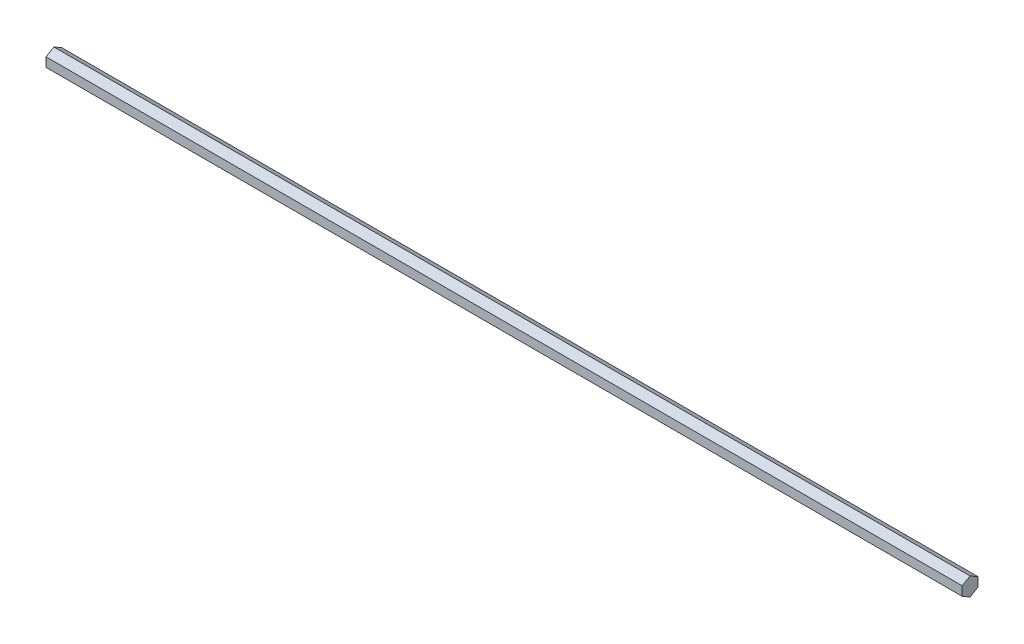
ISO-10303-21;
HEADER;
FILE_DESCRIPTION(('STEP AP214'),'2;1');
FILE_NAME('part.step','',(''),(''),'','','');
FILE_SCHEMA(('AUTOMOTIVE_DESIGN { 1 0 10303 214 1 1 1 1 }'));
ENDSEC;
DATA;
#1=APPLICATION_CONTEXT('core data for automotive mechanical design processes');
#2=APPLICATION_PROTOCOL_DEFINITION('international standard','automotive_design',2000,#1);
#3=PRODUCT_CONTEXT('',#1,'mechanical');
#4=PRODUCT('Part','Part','',(#3));
#5=PRODUCT_RELATED_PRODUCT_CATEGORY('part','',(#4));
#6=PRODUCT_DEFINITION_FORMATION('','',#4);
#7=PRODUCT_DEFINITION_CONTEXT('part definition',#1,'design');
#8=PRODUCT_DEFINITION('design','',#6,#7);
#9=PRODUCT_DEFINITION_SHAPE('','',#8);
#10=(LENGTH_UNIT() NAMED_UNIT(*) SI_UNIT(.MILLI.,.METRE.));
#11=(NAMED_UNIT(*) PLANE_ANGLE_UNIT() SI_UNIT($,.RADIAN.));
#12=(NAMED_UNIT(*) SI_UNIT($,.STERADIAN.) SOLID_ANGLE_UNIT());
#13=UNCERTAINTY_MEASURE_WITH_UNIT(LENGTH_MEASURE(1.E-05),#10,'distance_accuracy_value','');
#14=(GEOMETRIC_REPRESENTATION_CONTEXT(3) GLOBAL_UNCERTAINTY_ASSIGNED_CONTEXT((#13)) GLOBAL_UNIT_ASSIGNED_CONTEXT((#10,
#11,#12)) REPRESENTATION_CONTEXT('',''));
#15=CARTESIAN_POINT('',(0.,0.,0.));
#16=DIRECTION('',(0.,0.,1.));
#17=DIRECTION('',(1.,0.,0.));
#18=AXIS2_PLACEMENT_3D('',#15,#16,#17);
#19=CARTESIAN_POINT('',(736.6,3.6661742093542,-6.34999999999996));
#20=DIRECTION('',(0.,-0.866025403784442,0.499999999999995));
#21=DIRECTION('',(0.,-0.499999999999995,-0.866025403784442));
#22=AXIS2_PLACEMENT_3D('',#19,#20,#21);
#23=PLANE('',#22);
#24=DIRECTION('',(0.,0.499999999999995,0.866025403784441));
#25=VECTOR('',#24,1.);
#26=CARTESIAN_POINT('',(0.,3.6661742093542,-6.34999999999996));
#27=LINE('',#26,#25);
#28=CARTESIAN_POINT('',(0.,3.6661742093542,-6.34999999999996));
#29=VERTEX_POINT('',#28);
#30=CARTESIAN_POINT('',(0.,7.33234841870825,0.));
#31=VERTEX_POINT('',#30);
#32=EDGE_CURVE('E117',#29,#31,#27,.T.);
#33=ORIENTED_EDGE('',*,*,#32,.T.);
#34=DIRECTION('',(-1.,0.,0.));
#35=VECTOR('',#34,1.);
#36=CARTESIAN_POINT('',(736.6,7.33234841870825,0.));
#37=LINE('',#36,#35);
#38=CARTESIAN_POINT('',(736.6,7.33234841870825,0.));
#39=VERTEX_POINT('',#38);
#40=EDGE_CURVE('E11',#39,#31,#37,.T.);
#41=ORIENTED_EDGE('',*,*,#40,.F.);
#42=DIRECTION('',(0.,0.499999999999995,0.866025403784441));
#43=VECTOR('',#42,1.);
#44=CARTESIAN_POINT('',(736.6,3.6661742093542,-6.34999999999996));
#45=LINE('',#44,#43);
#46=CARTESIAN_POINT('',(736.6,3.6661742093542,-6.34999999999996));
#47=VERTEX_POINT('',#46);
#48=EDGE_CURVE('E127',#47,#39,#45,.T.);
#49=ORIENTED_EDGE('',*,*,#48,.F.);
#50=DIRECTION('',(-1.,0.,0.));
#51=VECTOR('',#50,1.);
#52=CARTESIAN_POINT('',(736.6,3.6661742093542,-6.34999999999996));
#53=LINE('',#52,#51);
#54=EDGE_CURVE('E113',#47,#29,#53,.T.);
#55=ORIENTED_EDGE('',*,*,#54,.T.);
#56=EDGE_LOOP('',(#33,#41,#49,#55));
#57=FACE_BOUND('',#56,.T.);
#58=ADVANCED_FACE('F33',(#57),#23,.F.);
#59=CARTESIAN_POINT('',(736.6,7.33234841870825,0.));
#60=DIRECTION('',(0.,-0.866025403784438,-0.500000000000001));
#61=DIRECTION('',(0.,0.500000000000001,-0.866025403784438));
#62=AXIS2_PLACEMENT_3D('',#59,#60,#61);
#63=PLANE('',#62);
#64=DIRECTION('',(0.,-0.500000000000001,0.866025403784438));
#65=VECTOR('',#64,1.);
#66=CARTESIAN_POINT('',(0.,7.33234841870825,0.));
#67=LINE('',#66,#65);
#68=CARTESIAN_POINT('',(0.,3.66617420935411,6.35000000000001));
#69=VERTEX_POINT('',#68);
#70=EDGE_CURVE('E120',#31,#69,#67,.T.);
#71=ORIENTED_EDGE('',*,*,#70,.T.);
#72=DIRECTION('',(-1.,0.,0.));
#73=VECTOR('',#72,1.);
#74=CARTESIAN_POINT('',(736.6,3.66617420935411,6.35000000000001));
#75=LINE('',#74,#73);
#76=CARTESIAN_POINT('',(736.6,3.66617420935411,6.35000000000001));
#77=VERTEX_POINT('',#76);
#78=EDGE_CURVE('E41',#77,#69,#75,.T.);
#79=ORIENTED_EDGE('',*,*,#78,.F.);
#80=DIRECTION('',(0.,-0.500000000000001,0.866025403784438));
#81=VECTOR('',#80,1.);
#82=CARTESIAN_POINT('',(736.6,7.33234841870825,0.));
#83=LINE('',#82,#81);
#84=EDGE_CURVE('E86',#39,#77,#83,.T.);
#85=ORIENTED_EDGE('',*,*,#84,.F.);
#86=ORIENTED_EDGE('',*,*,#40,.T.);
#87=EDGE_LOOP('',(#71,#79,#85,#86));
#88=FACE_BOUND('',#87,.T.);
#89=ADVANCED_FACE('F151',(#88),#63,.F.);
#90=CARTESIAN_POINT('',(736.6,3.66617420935411,6.35000000000001));
#91=DIRECTION('',(0.,0.,-1.));
#92=DIRECTION('',(0.,1.,0.));
#93=AXIS2_PLACEMENT_3D('',#90,#91,#92);
#94=PLANE('',#93);
#95=DIRECTION('',(0.,-1.,0.));
#96=VECTOR('',#95,1.);
#97=CARTESIAN_POINT('',(0.,3.66617420935411,6.35000000000001));
#98=LINE('',#97,#96);
#99=CARTESIAN_POINT('',(0.,-3.66617420935416,6.34999999999999));
#100=VERTEX_POINT('',#99);
#101=EDGE_CURVE('E122',#69,#100,#98,.T.);
#102=ORIENTED_EDGE('',*,*,#101,.T.);
#103=DIRECTION('',(-1.,0.,0.));
#104=VECTOR('',#103,1.);
#105=CARTESIAN_POINT('',(736.6,-3.66617420935416,6.34999999999999));
#106=LINE('',#105,#104);
#107=CARTESIAN_POINT('',(736.6,-3.66617420935416,6.34999999999999));
#108=VERTEX_POINT('',#107);
#109=EDGE_CURVE('E108',#108,#100,#106,.T.);
#110=ORIENTED_EDGE('',*,*,#109,.F.);
#111=DIRECTION('',(0.,-1.,0.));
#112=VECTOR('',#111,1.);
#113=CARTESIAN_POINT('',(736.6,3.66617420935411,6.35000000000001));
#114=LINE('',#113,#112);
#115=EDGE_CURVE('E99',#77,#108,#114,.T.);
#116=ORIENTED_EDGE('',*,*,#115,.F.);
#117=ORIENTED_EDGE('',*,*,#78,.T.);
#118=EDGE_LOOP('',(#102,#110,#116,#117));
#119=FACE_BOUND('',#118,.T.);
#120=ADVANCED_FACE('F133',(#119),#94,.F.);
#121=CARTESIAN_POINT('',(736.6,-3.66617420935416,6.34999999999999));
#122=DIRECTION('',(0.,0.866025403784442,-0.499999999999995));
#123=DIRECTION('',(0.,0.499999999999995,0.866025403784442));
#124=AXIS2_PLACEMENT_3D('',#121,#122,#123);
#125=PLANE('',#124);
#126=DIRECTION('',(0.,-0.499999999999995,-0.866025403784442));
#127=VECTOR('',#126,1.);
#128=CARTESIAN_POINT('',(0.,-3.66617420935416,6.34999999999999));
#129=LINE('',#128,#127);
#130=CARTESIAN_POINT('',(0.,-7.33234841870825,0.));
#131=VERTEX_POINT('',#130);
#132=EDGE_CURVE('E107',#100,#131,#129,.T.);
#133=ORIENTED_EDGE('',*,*,#132,.T.);
#134=DIRECTION('',(-1.,0.,0.));
#135=VECTOR('',#134,1.);
#136=CARTESIAN_POINT('',(736.6,-7.33234841870825,0.));
#137=LINE('',#136,#135);
#138=CARTESIAN_POINT('',(736.6,-7.33234841870825,0.));
#139=VERTEX_POINT('',#138);
#140=EDGE_CURVE('E104',#139,#131,#137,.T.);
#141=ORIENTED_EDGE('',*,*,#140,.F.);
#142=DIRECTION('',(0.,-0.499999999999995,-0.866025403784442));
#143=VECTOR('',#142,1.);
#144=CARTESIAN_POINT('',(736.6,-3.66617420935416,6.34999999999999));
#145=LINE('',#144,#143);
#146=EDGE_CURVE('E93',#108,#139,#145,.T.);
#147=ORIENTED_EDGE('',*,*,#146,.F.);
#148=ORIENTED_EDGE('',*,*,#109,.T.);
#149=EDGE_LOOP('',(#133,#141,#147,#148));
#150=FACE_BOUND('',#149,.T.);
#151=ADVANCED_FACE('F105',(#150),#125,.F.);
#152=CARTESIAN_POINT('',(736.6,-7.33234841870825,0.));
#153=DIRECTION('',(0.,0.866025403784435,0.500000000000007));
#154=DIRECTION('',(0.,-0.500000000000007,0.866025403784435));
#155=AXIS2_PLACEMENT_3D('',#152,#153,#154);
#156=PLANE('',#155);
#157=DIRECTION('',(0.,0.500000000000007,-0.866025403784435));
#158=VECTOR('',#157,1.);
#159=CARTESIAN_POINT('',(0.,-7.33234841870825,0.));
#160=LINE('',#159,#158);
#161=CARTESIAN_POINT('',(0.,-3.66617420935407,-6.35000000000004));
#162=VERTEX_POINT('',#161);
#163=EDGE_CURVE('E72',#131,#162,#160,.T.);
#164=ORIENTED_EDGE('',*,*,#163,.T.);
#165=DIRECTION('',(-1.,0.,0.));
#166=VECTOR('',#165,1.);
#167=CARTESIAN_POINT('',(736.6,-3.66617420935407,-6.35000000000004));
#168=LINE('',#167,#166);
#169=CARTESIAN_POINT('',(736.6,-3.66617420935407,-6.35000000000004));
#170=VERTEX_POINT('',#169);
#171=EDGE_CURVE('E109',#170,#162,#168,.T.);
#172=ORIENTED_EDGE('',*,*,#171,.F.);
#173=DIRECTION('',(0.,0.500000000000007,-0.866025403784435));
#174=VECTOR('',#173,1.);
#175=CARTESIAN_POINT('',(736.6,-7.33234841870825,0.));
#176=LINE('',#175,#174);
#177=EDGE_CURVE('E97',#139,#170,#176,.T.);
#178=ORIENTED_EDGE('',*,*,#177,.F.);
#179=ORIENTED_EDGE('',*,*,#140,.T.);
#180=EDGE_LOOP('',(#164,#172,#178,#179));
#181=FACE_BOUND('',#180,.T.);
#182=ADVANCED_FACE('F111',(#181),#156,.F.);
#183=CARTESIAN_POINT('',(736.6,-3.66617420935407,-6.35000000000004));
#184=DIRECTION('',(0.,0.,1.));
#185=DIRECTION('',(0.,-1.,0.));
#186=AXIS2_PLACEMENT_3D('',#183,#184,#185);
#187=PLANE('',#186);
#188=DIRECTION('',(0.,1.,0.));
#189=VECTOR('',#188,1.);
#190=CARTESIAN_POINT('',(0.,-3.66617420935407,-6.35000000000004));
#191=LINE('',#190,#189);
#192=EDGE_CURVE('E78',#162,#29,#191,.T.);
#193=ORIENTED_EDGE('',*,*,#192,.T.);
#194=ORIENTED_EDGE('',*,*,#54,.F.);
#195=DIRECTION('',(0.,1.,0.));
#196=VECTOR('',#195,1.);
#197=CARTESIAN_POINT('',(736.6,-3.66617420935407,-6.35000000000004));
#198=LINE('',#197,#196);
#199=EDGE_CURVE('E49',#170,#47,#198,.T.);
#200=ORIENTED_EDGE('',*,*,#199,.F.);
#201=ORIENTED_EDGE('',*,*,#171,.T.);
#202=EDGE_LOOP('',(#193,#194,#200,#201));
#203=FACE_BOUND('',#202,.T.);
#204=ADVANCED_FACE('F140',(#203),#187,.F.);
#205=CARTESIAN_POINT('',(736.6,0.,0.));
#206=DIRECTION('',(1.,0.,0.));
#207=DIRECTION('',(0.,0.,-1.));
#208=AXIS2_PLACEMENT_3D('',#205,#206,#207);
#209=PLANE('',#208);
#210=ORIENTED_EDGE('',*,*,#48,.T.);
#211=ORIENTED_EDGE('',*,*,#84,.T.);
#212=ORIENTED_EDGE('',*,*,#115,.T.);
#213=ORIENTED_EDGE('',*,*,#146,.T.);
#214=ORIENTED_EDGE('',*,*,#177,.T.);
#215=ORIENTED_EDGE('',*,*,#199,.T.);
#216=EDGE_LOOP('',(#210,#211,#212,#213,#214,#215));
#217=FACE_BOUND('',#216,.T.);
#218=ADVANCED_FACE('F95',(#217),#209,.T.);
#219=CARTESIAN_POINT('',(0.,0.,0.));
#220=DIRECTION('',(1.,0.,0.));
#221=DIRECTION('',(0.,0.,-1.));
#222=AXIS2_PLACEMENT_3D('',#219,#220,#221);
#223=PLANE('',#222);
#224=ORIENTED_EDGE('',*,*,#32,.F.);
#225=ORIENTED_EDGE('',*,*,#192,.F.);
#226=ORIENTED_EDGE('',*,*,#163,.F.);
#227=ORIENTED_EDGE('',*,*,#132,.F.);
#228=ORIENTED_EDGE('',*,*,#101,.F.);
#229=ORIENTED_EDGE('',*,*,#70,.F.);
#230=EDGE_LOOP('',(#224,#225,#226,#227,#228,#229));
#231=FACE_BOUND('',#230,.T.);
#232=ADVANCED_FACE('F136',(#231),#223,.F.);
#233=CLOSED_SHELL('',(#58,#89,#120,#151,#182,#204,#218,#232));
#234=MANIFOLD_SOLID_BREP('B2',#233);
#235=ADVANCED_BREP_SHAPE_REPRESENTATION('',(#18,#234),#14);
#236=SHAPE_DEFINITION_REPRESENTATION(#9,#235);
ENDSEC;
END-ISO-10303-21;
